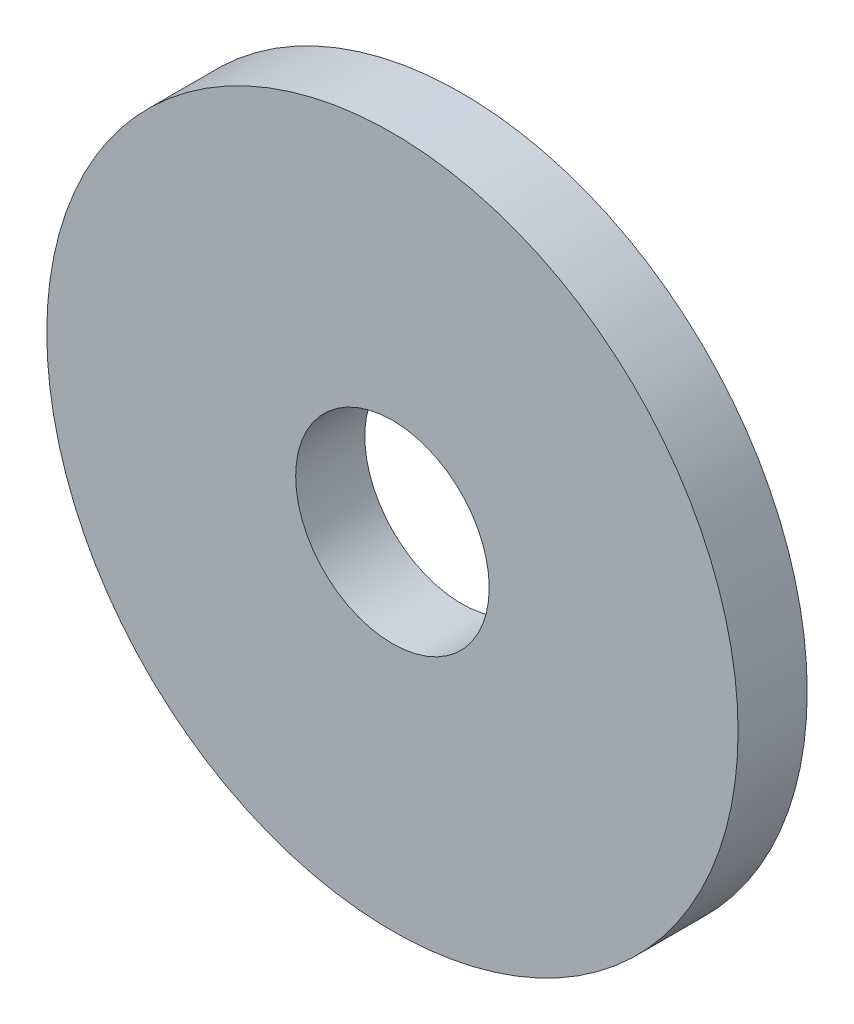
ISO-10303-21;
HEADER;
FILE_DESCRIPTION(('STEP AP214'),'2;1');
FILE_NAME('part.step','',(''),(''),'','','');
FILE_SCHEMA(('AUTOMOTIVE_DESIGN { 1 0 10303 214 1 1 1 1 }'));
ENDSEC;
DATA;
#1=APPLICATION_CONTEXT('core data for automotive mechanical design processes');
#2=APPLICATION_PROTOCOL_DEFINITION('international standard','automotive_design',2000,#1);
#3=PRODUCT_CONTEXT('',#1,'mechanical');
#4=PRODUCT('Part','Part','',(#3));
#5=PRODUCT_RELATED_PRODUCT_CATEGORY('part','',(#4));
#6=PRODUCT_DEFINITION_FORMATION('','',#4);
#7=PRODUCT_DEFINITION_CONTEXT('part definition',#1,'design');
#8=PRODUCT_DEFINITION('design','',#6,#7);
#9=PRODUCT_DEFINITION_SHAPE('','',#8);
#10=(LENGTH_UNIT() NAMED_UNIT(*) SI_UNIT(.MILLI.,.METRE.));
#11=(NAMED_UNIT(*) PLANE_ANGLE_UNIT() SI_UNIT($,.RADIAN.));
#12=(NAMED_UNIT(*) SI_UNIT($,.STERADIAN.) SOLID_ANGLE_UNIT());
#13=UNCERTAINTY_MEASURE_WITH_UNIT(LENGTH_MEASURE(1.E-05),#10,'distance_accuracy_value','');
#14=(GEOMETRIC_REPRESENTATION_CONTEXT(3) GLOBAL_UNCERTAINTY_ASSIGNED_CONTEXT((#13)) GLOBAL_UNIT_ASSIGNED_CONTEXT((#10,
#11,#12)) REPRESENTATION_CONTEXT('',''));
#15=CARTESIAN_POINT('',(0.,0.,0.));
#16=DIRECTION('',(0.,0.,1.));
#17=DIRECTION('',(1.,0.,0.));
#18=AXIS2_PLACEMENT_3D('',#15,#16,#17);
#19=CARTESIAN_POINT('',(95.8640747020422,45.4655790408734,-3.175));
#20=DIRECTION('',(0.,0.,1.));
#21=DIRECTION('',(1.,0.,0.));
#22=AXIS2_PLACEMENT_3D('',#19,#20,#21);
#23=PLANE('',#22);
#24=CARTESIAN_POINT('',(95.8640747020422,45.4655790408734,-3.175));
#25=DIRECTION('',(0.,0.,1.));
#26=DIRECTION('',(1.,0.,0.));
#27=AXIS2_PLACEMENT_3D('',#24,#25,#26);
#28=CIRCLE('',#27,8.00099999999999);
#29=CARTESIAN_POINT('',(103.865074702042,45.4655790408734,-3.175));
#30=VERTEX_POINT('',#29);
#31=EDGE_CURVE('E10',#30,#30,#28,.T.);
#32=ORIENTED_EDGE('',*,*,#31,.T.);
#33=EDGE_LOOP('',(#32));
#34=FACE_BOUND('',#33,.T.);
#35=CARTESIAN_POINT('',(95.8640747020422,45.4655790408734,-3.175));
#36=DIRECTION('',(0.,0.,-1.));
#37=DIRECTION('',(-1.,0.,0.));
#38=AXIS2_PLACEMENT_3D('',#35,#36,#37);
#39=CIRCLE('',#38,28.575);
#40=CARTESIAN_POINT('',(67.2890747020422,45.4655790408734,-3.175));
#41=VERTEX_POINT('',#40);
#42=EDGE_CURVE('E46',#41,#41,#39,.T.);
#43=ORIENTED_EDGE('',*,*,#42,.T.);
#44=EDGE_LOOP('',(#43));
#45=FACE_BOUND('',#44,.T.);
#46=ADVANCED_FACE('F32',(#34,#45),#23,.F.);
#47=CARTESIAN_POINT('',(95.8640747020422,45.4655790408734,-3.175));
#48=DIRECTION('',(0.,0.,1.));
#49=DIRECTION('',(1.,0.,0.));
#50=AXIS2_PLACEMENT_3D('',#47,#48,#49);
#51=CYLINDRICAL_SURFACE('',#50,8.00099999999999);
#52=ORIENTED_EDGE('',*,*,#31,.F.);
#53=EDGE_LOOP('',(#52));
#54=FACE_BOUND('',#53,.T.);
#55=CARTESIAN_POINT('',(95.8640747020422,45.4655790408734,2.54));
#56=DIRECTION('',(0.,0.,-1.));
#57=DIRECTION('',(-1.,0.,0.));
#58=AXIS2_PLACEMENT_3D('',#55,#56,#57);
#59=CIRCLE('',#58,8.00099999999999);
#60=CARTESIAN_POINT('',(87.8630747020422,45.4655790408734,2.54));
#61=VERTEX_POINT('',#60);
#62=EDGE_CURVE('E38',#61,#61,#59,.F.);
#63=ORIENTED_EDGE('',*,*,#62,.T.);
#64=EDGE_LOOP('',(#63));
#65=FACE_BOUND('',#64,.T.);
#66=ADVANCED_FACE('F61',(#54,#65),#51,.F.);
#67=CARTESIAN_POINT('',(95.8640747020422,45.4655790408734,2.54));
#68=DIRECTION('',(0.,0.,-1.));
#69=DIRECTION('',(-1.,0.,0.));
#70=AXIS2_PLACEMENT_3D('',#67,#68,#69);
#71=PLANE('',#70);
#72=ORIENTED_EDGE('',*,*,#62,.F.);
#73=EDGE_LOOP('',(#72));
#74=FACE_BOUND('',#73,.T.);
#75=CARTESIAN_POINT('',(95.8640747020422,45.4655790408734,2.54));
#76=DIRECTION('',(0.,0.,-1.));
#77=DIRECTION('',(-1.,0.,0.));
#78=AXIS2_PLACEMENT_3D('',#75,#76,#77);
#79=CIRCLE('',#78,28.575);
#80=CARTESIAN_POINT('',(67.2890747020422,45.4655790408734,2.54));
#81=VERTEX_POINT('',#80);
#82=EDGE_CURVE('E42',#81,#81,#79,.F.);
#83=ORIENTED_EDGE('',*,*,#82,.T.);
#84=EDGE_LOOP('',(#83));
#85=FACE_BOUND('',#84,.T.);
#86=ADVANCED_FACE('F55',(#74,#85),#71,.F.);
#87=CARTESIAN_POINT('',(95.8640747020422,45.4655790408734,83.3623050896224));
#88=DIRECTION('',(0.,0.,-1.));
#89=DIRECTION('',(-1.,0.,0.));
#90=AXIS2_PLACEMENT_3D('',#87,#88,#89);
#91=CYLINDRICAL_SURFACE('',#90,28.575);
#92=ORIENTED_EDGE('',*,*,#82,.F.);
#93=EDGE_LOOP('',(#92));
#94=FACE_BOUND('',#93,.T.);
#95=ORIENTED_EDGE('',*,*,#42,.F.);
#96=EDGE_LOOP('',(#95));
#97=FACE_BOUND('',#96,.T.);
#98=ADVANCED_FACE('F53',(#94,#97),#91,.T.);
#99=CLOSED_SHELL('',(#46,#66,#86,#98));
#100=MANIFOLD_SOLID_BREP('B2',#99);
#101=ADVANCED_BREP_SHAPE_REPRESENTATION('',(#18,#100),#14);
#102=SHAPE_DEFINITION_REPRESENTATION(#9,#101);
ENDSEC;
END-ISO-10303-21;
